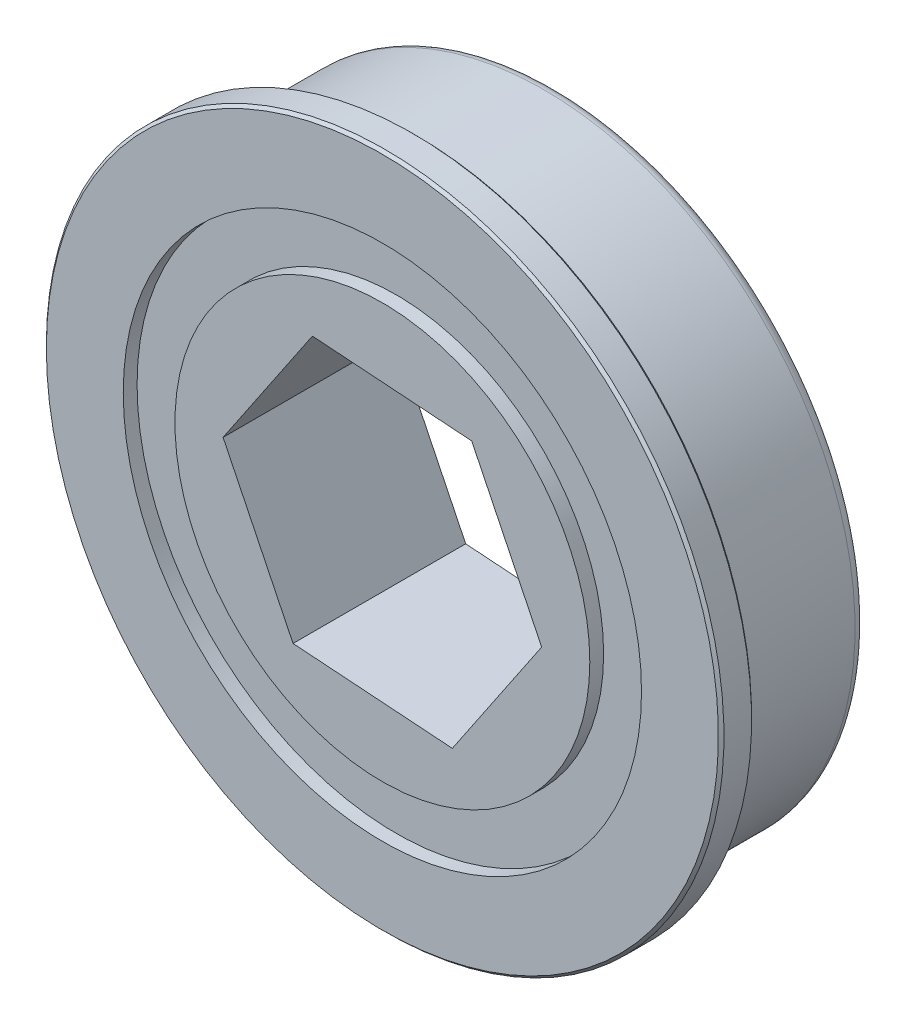
ISO-10303-21;
HEADER;
FILE_DESCRIPTION(('STEP AP214'),'2;1');
FILE_NAME('part.step','',(''),(''),'','','');
FILE_SCHEMA(('AUTOMOTIVE_DESIGN { 1 0 10303 214 1 1 1 1 }'));
ENDSEC;
DATA;
#1=APPLICATION_CONTEXT('core data for automotive mechanical design processes');
#2=APPLICATION_PROTOCOL_DEFINITION('international standard','automotive_design',2000,#1);
#3=PRODUCT_CONTEXT('',#1,'mechanical');
#4=PRODUCT('Part','Part','',(#3));
#5=PRODUCT_RELATED_PRODUCT_CATEGORY('part','',(#4));
#6=PRODUCT_DEFINITION_FORMATION('','',#4);
#7=PRODUCT_DEFINITION_CONTEXT('part definition',#1,'design');
#8=PRODUCT_DEFINITION('design','',#6,#7);
#9=PRODUCT_DEFINITION_SHAPE('','',#8);
#10=(LENGTH_UNIT() NAMED_UNIT(*) SI_UNIT(.MILLI.,.METRE.));
#11=(NAMED_UNIT(*) PLANE_ANGLE_UNIT() SI_UNIT($,.RADIAN.));
#12=(NAMED_UNIT(*) SI_UNIT($,.STERADIAN.) SOLID_ANGLE_UNIT());
#13=UNCERTAINTY_MEASURE_WITH_UNIT(LENGTH_MEASURE(1.E-05),#10,'distance_accuracy_value','');
#14=(GEOMETRIC_REPRESENTATION_CONTEXT(3) GLOBAL_UNCERTAINTY_ASSIGNED_CONTEXT((#13)) GLOBAL_UNIT_ASSIGNED_CONTEXT((#10,
#11,#12)) REPRESENTATION_CONTEXT('',''));
#15=CARTESIAN_POINT('',(0.,0.,0.));
#16=DIRECTION('',(0.,0.,1.));
#17=DIRECTION('',(1.,0.,0.));
#18=AXIS2_PLACEMENT_3D('',#15,#16,#17);
#19=CARTESIAN_POINT('',(0.,0.,-0.000999999999999265));
#20=DIRECTION('',(0.,0.,1.));
#21=DIRECTION('',(1.,0.,0.));
#22=AXIS2_PLACEMENT_3D('',#19,#20,#21);
#23=CYLINDRICAL_SURFACE('',#22,11.8991111578808);
#24=CARTESIAN_POINT('',(0.,0.,0.635));
#25=DIRECTION('',(0.,0.,-1.));
#26=DIRECTION('',(-1.,0.,0.));
#27=AXIS2_PLACEMENT_3D('',#24,#25,#26);
#28=CIRCLE('',#27,11.8991111578808);
#29=CARTESIAN_POINT('',(-11.8991111578808,0.,0.635));
#30=VERTEX_POINT('',#29);
#31=EDGE_CURVE('E154',#30,#30,#28,.T.);
#32=ORIENTED_EDGE('',*,*,#31,.F.);
#33=EDGE_LOOP('',(#32));
#34=FACE_BOUND('',#33,.T.);
#35=CARTESIAN_POINT('',(0.,0.,0.));
#36=DIRECTION('',(0.,0.,-1.));
#37=DIRECTION('',(-1.,0.,0.));
#38=AXIS2_PLACEMENT_3D('',#35,#36,#37);
#39=CIRCLE('',#38,11.8991111578808);
#40=CARTESIAN_POINT('',(-11.8991111578808,0.,0.));
#41=VERTEX_POINT('',#40);
#42=EDGE_CURVE('E158',#41,#41,#39,.F.);
#43=ORIENTED_EDGE('',*,*,#42,.F.);
#44=EDGE_LOOP('',(#43));
#45=FACE_BOUND('',#44,.T.);
#46=ADVANCED_FACE('F40',(#34,#45),#23,.F.);
#47=CARTESIAN_POINT('',(0.,0.,7.80034));
#48=DIRECTION('',(0.,0.,-1.));
#49=DIRECTION('',(-1.,0.,0.));
#50=AXIS2_PLACEMENT_3D('',#47,#48,#49);
#51=CONICAL_SURFACE('',#50,15.5575,0.785398163397442);
#52=CARTESIAN_POINT('',(0.,0.,7.92734));
#53=DIRECTION('',(0.,0.,-1.));
#54=DIRECTION('',(-1.,0.,0.));
#55=AXIS2_PLACEMENT_3D('',#52,#53,#54);
#56=CIRCLE('',#55,15.4305);
#57=CARTESIAN_POINT('',(-15.4305,0.,7.92734));
#58=VERTEX_POINT('',#57);
#59=EDGE_CURVE('E189',#58,#58,#56,.T.);
#60=ORIENTED_EDGE('',*,*,#59,.T.);
#61=EDGE_LOOP('',(#60));
#62=FACE_BOUND('',#61,.T.);
#63=CARTESIAN_POINT('',(0.,0.,7.80034));
#64=DIRECTION('',(0.,0.,-1.));
#65=DIRECTION('',(-1.,0.,0.));
#66=AXIS2_PLACEMENT_3D('',#63,#64,#65);
#67=CIRCLE('',#66,15.5575);
#68=CARTESIAN_POINT('',(-15.5575,0.,7.80034));
#69=VERTEX_POINT('',#68);
#70=EDGE_CURVE('E170',#69,#69,#67,.T.);
#71=ORIENTED_EDGE('',*,*,#70,.F.);
#72=EDGE_LOOP('',(#71));
#73=FACE_BOUND('',#72,.T.);
#74=ADVANCED_FACE('F221',(#62,#73),#51,.T.);
#75=CARTESIAN_POINT('',(15.4305,0.,7.92734));
#76=DIRECTION('',(0.,0.,1.));
#77=DIRECTION('',(1.,0.,0.));
#78=AXIS2_PLACEMENT_3D('',#75,#76,#77);
#79=PLANE('',#78);
#80=CARTESIAN_POINT('',(0.,0.,7.92734));
#81=DIRECTION('',(0.,0.,1.));
#82=DIRECTION('',(1.,0.,0.));
#83=AXIS2_PLACEMENT_3D('',#80,#81,#82);
#84=CIRCLE('',#83,11.8991111578808);
#85=CARTESIAN_POINT('',(11.8991111578808,0.,7.92734));
#86=VERTEX_POINT('',#85);
#87=EDGE_CURVE('E166',#86,#86,#84,.T.);
#88=ORIENTED_EDGE('',*,*,#87,.F.);
#89=EDGE_LOOP('',(#88));
#90=FACE_BOUND('',#89,.T.);
#91=ORIENTED_EDGE('',*,*,#59,.F.);
#92=EDGE_LOOP('',(#91));
#93=FACE_BOUND('',#92,.T.);
#94=ADVANCED_FACE('F226',(#90,#93),#79,.T.);
#95=CARTESIAN_POINT('',(0.,0.,0.));
#96=DIRECTION('',(0.,0.,-1.));
#97=DIRECTION('',(-1.,0.,0.));
#98=AXIS2_PLACEMENT_3D('',#95,#96,#97);
#99=PLANE('',#98);
#100=ORIENTED_EDGE('',*,*,#42,.T.);
#101=EDGE_LOOP('',(#100));
#102=FACE_BOUND('',#101,.T.);
#103=CARTESIAN_POINT('',(0.,0.,0.));
#104=DIRECTION('',(0.,0.,-1.));
#105=DIRECTION('',(-1.,0.,0.));
#106=AXIS2_PLACEMENT_3D('',#103,#104,#105);
#107=CIRCLE('',#106,13.7795);
#108=CARTESIAN_POINT('',(-13.7795,0.,0.));
#109=VERTEX_POINT('',#108);
#110=EDGE_CURVE('E49',#109,#109,#107,.T.);
#111=ORIENTED_EDGE('',*,*,#110,.T.);
#112=EDGE_LOOP('',(#111));
#113=FACE_BOUND('',#112,.T.);
#114=ADVANCED_FACE('F204',(#102,#113),#99,.T.);
#115=CARTESIAN_POINT('',(0.,0.,7.92734));
#116=DIRECTION('',(0.,0.,-1.));
#117=DIRECTION('',(-1.,0.,0.));
#118=AXIS2_PLACEMENT_3D('',#115,#116,#117);
#119=CYLINDRICAL_SURFACE('',#118,14.2875);
#120=CARTESIAN_POINT('',(0.,0.,0.508));
#121=DIRECTION('',(0.,0.,-1.));
#122=DIRECTION('',(-1.,0.,0.));
#123=AXIS2_PLACEMENT_3D('',#120,#121,#122);
#124=CIRCLE('',#123,14.2875);
#125=CARTESIAN_POINT('',(-14.2875,0.,0.508));
#126=VERTEX_POINT('',#125);
#127=EDGE_CURVE('E12',#126,#126,#124,.F.);
#128=ORIENTED_EDGE('',*,*,#127,.T.);
#129=EDGE_LOOP('',(#128));
#130=FACE_BOUND('',#129,.T.);
#131=CARTESIAN_POINT('',(0.,0.,5.89534));
#132=DIRECTION('',(0.,0.,-1.));
#133=DIRECTION('',(-1.,0.,0.));
#134=AXIS2_PLACEMENT_3D('',#131,#132,#133);
#135=CIRCLE('',#134,14.2875);
#136=CARTESIAN_POINT('',(-14.2875,0.,5.89534));
#137=VERTEX_POINT('',#136);
#138=EDGE_CURVE('E185',#137,#137,#135,.T.);
#139=ORIENTED_EDGE('',*,*,#138,.T.);
#140=EDGE_LOOP('',(#139));
#141=FACE_BOUND('',#140,.T.);
#142=ADVANCED_FACE('F249',(#130,#141),#119,.T.);
#143=CARTESIAN_POINT('',(14.2875,0.,5.89534));
#144=DIRECTION('',(0.,0.,1.));
#145=DIRECTION('',(1.,0.,0.));
#146=AXIS2_PLACEMENT_3D('',#143,#144,#145);
#147=PLANE('',#146);
#148=CARTESIAN_POINT('',(0.,0.,5.89534));
#149=DIRECTION('',(0.,0.,-1.));
#150=DIRECTION('',(-1.,0.,0.));
#151=AXIS2_PLACEMENT_3D('',#148,#149,#150);
#152=CIRCLE('',#151,13.97);
#153=CARTESIAN_POINT('',(-13.97,0.,5.89534));
#154=VERTEX_POINT('',#153);
#155=EDGE_CURVE('E181',#154,#154,#152,.T.);
#156=ORIENTED_EDGE('',*,*,#155,.T.);
#157=EDGE_LOOP('',(#156));
#158=FACE_BOUND('',#157,.T.);
#159=ORIENTED_EDGE('',*,*,#138,.F.);
#160=EDGE_LOOP('',(#159));
#161=FACE_BOUND('',#160,.T.);
#162=ADVANCED_FACE('F245',(#158,#161),#147,.T.);
#163=CARTESIAN_POINT('',(0.,0.,7.92734));
#164=DIRECTION('',(0.,0.,-1.));
#165=DIRECTION('',(-1.,0.,0.));
#166=AXIS2_PLACEMENT_3D('',#163,#164,#165);
#167=CYLINDRICAL_SURFACE('',#166,13.97);
#168=CARTESIAN_POINT('',(0.,0.,6.40333999999999));
#169=DIRECTION('',(0.,0.,-1.));
#170=DIRECTION('',(-1.,0.,0.));
#171=AXIS2_PLACEMENT_3D('',#168,#169,#170);
#172=CIRCLE('',#171,13.97);
#173=CARTESIAN_POINT('',(-13.97,0.,6.40333999999999));
#174=VERTEX_POINT('',#173);
#175=EDGE_CURVE('E177',#174,#174,#172,.T.);
#176=ORIENTED_EDGE('',*,*,#175,.T.);
#177=EDGE_LOOP('',(#176));
#178=FACE_BOUND('',#177,.T.);
#179=ORIENTED_EDGE('',*,*,#155,.F.);
#180=EDGE_LOOP('',(#179));
#181=FACE_BOUND('',#180,.T.);
#182=ADVANCED_FACE('F241',(#178,#181),#167,.T.);
#183=CARTESIAN_POINT('',(13.97,0.,6.40334));
#184=DIRECTION('',(0.,0.,-1.));
#185=DIRECTION('',(-1.,0.,0.));
#186=AXIS2_PLACEMENT_3D('',#183,#184,#185);
#187=PLANE('',#186);
#188=CARTESIAN_POINT('',(0.,0.,6.40334));
#189=DIRECTION('',(0.,0.,-1.));
#190=DIRECTION('',(-1.,0.,0.));
#191=AXIS2_PLACEMENT_3D('',#188,#189,#190);
#192=CIRCLE('',#191,15.4305);
#193=CARTESIAN_POINT('',(-15.4305,0.,6.40334));
#194=VERTEX_POINT('',#193);
#195=EDGE_CURVE('E193',#194,#194,#192,.T.);
#196=ORIENTED_EDGE('',*,*,#195,.T.);
#197=EDGE_LOOP('',(#196));
#198=FACE_BOUND('',#197,.T.);
#199=ORIENTED_EDGE('',*,*,#175,.F.);
#200=EDGE_LOOP('',(#199));
#201=FACE_BOUND('',#200,.T.);
#202=ADVANCED_FACE('F237',(#198,#201),#187,.T.);
#203=CARTESIAN_POINT('',(0.,0.,7.92734));
#204=DIRECTION('',(0.,0.,-1.));
#205=DIRECTION('',(-1.,0.,0.));
#206=AXIS2_PLACEMENT_3D('',#203,#204,#205);
#207=CYLINDRICAL_SURFACE('',#206,15.5575);
#208=CARTESIAN_POINT('',(0.,0.,6.53034000000001));
#209=DIRECTION('',(0.,0.,-1.));
#210=DIRECTION('',(-1.,0.,0.));
#211=AXIS2_PLACEMENT_3D('',#208,#209,#210);
#212=CIRCLE('',#211,15.5575);
#213=CARTESIAN_POINT('',(-15.5575,0.,6.53034000000001));
#214=VERTEX_POINT('',#213);
#215=EDGE_CURVE('E197',#214,#214,#212,.F.);
#216=ORIENTED_EDGE('',*,*,#215,.T.);
#217=EDGE_LOOP('',(#216));
#218=FACE_BOUND('',#217,.T.);
#219=ORIENTED_EDGE('',*,*,#70,.T.);
#220=EDGE_LOOP('',(#219));
#221=FACE_BOUND('',#220,.T.);
#222=ADVANCED_FACE('F217',(#218,#221),#207,.T.);
#223=CARTESIAN_POINT('',(0.,0.,6.40334));
#224=DIRECTION('',(0.,0.,1.));
#225=DIRECTION('',(1.,0.,0.));
#226=AXIS2_PLACEMENT_3D('',#223,#224,#225);
#227=CONICAL_SURFACE('',#226,15.4305,0.785398163397407);
#228=ORIENTED_EDGE('',*,*,#215,.F.);
#229=EDGE_LOOP('',(#228));
#230=FACE_BOUND('',#229,.T.);
#231=ORIENTED_EDGE('',*,*,#195,.F.);
#232=EDGE_LOOP('',(#231));
#233=FACE_BOUND('',#232,.T.);
#234=ADVANCED_FACE('F208',(#230,#233),#227,.T.);
#235=CARTESIAN_POINT('',(0.,0.,0.508));
#236=DIRECTION('',(0.,0.,-1.));
#237=DIRECTION('',(-1.,0.,0.));
#238=AXIS2_PLACEMENT_3D('',#235,#236,#237);
#239=TOROIDAL_SURFACE('',#238,13.7795,0.508);
#240=ORIENTED_EDGE('',*,*,#127,.F.);
#241=EDGE_LOOP('',(#240));
#242=FACE_BOUND('',#241,.T.);
#243=ORIENTED_EDGE('',*,*,#110,.F.);
#244=EDGE_LOOP('',(#243));
#245=FACE_BOUND('',#244,.T.);
#246=ADVANCED_FACE('F42',(#242,#245),#239,.T.);
#247=CARTESIAN_POINT('',(0.,0.,7.29234));
#248=DIRECTION('',(0.,0.,1.));
#249=DIRECTION('',(1.,0.,0.));
#250=AXIS2_PLACEMENT_3D('',#247,#248,#249);
#251=CIRCLE('',#250,11.8991111578808);
#252=CARTESIAN_POINT('',(11.8991111578808,0.,7.29234));
#253=VERTEX_POINT('',#252);
#254=EDGE_CURVE('E153',#253,#253,#251,.F.);
#255=ORIENTED_EDGE('',*,*,#254,.T.);
#256=EDGE_LOOP('',(#255));
#257=FACE_BOUND('',#256,.T.);
#258=ORIENTED_EDGE('',*,*,#87,.T.);
#259=EDGE_LOOP('',(#258));
#260=FACE_BOUND('',#259,.T.);
#261=ADVANCED_FACE('F207',(#257,#260),#23,.F.);
#262=CARTESIAN_POINT('',(0.,0.,0.635));
#263=DIRECTION('',(0.,0.,-1.));
#264=DIRECTION('',(-1.,0.,0.));
#265=AXIS2_PLACEMENT_3D('',#262,#263,#264);
#266=PLANE('',#265);
#267=CARTESIAN_POINT('',(0.,0.,0.635));
#268=DIRECTION('',(0.,0.,-1.));
#269=DIRECTION('',(-1.,0.,0.));
#270=AXIS2_PLACEMENT_3D('',#267,#268,#269);
#271=CIRCLE('',#270,9.525);
#272=CARTESIAN_POINT('',(-9.525,0.,0.635));
#273=VERTEX_POINT('',#272);
#274=EDGE_CURVE('E159',#273,#273,#271,.T.);
#275=ORIENTED_EDGE('',*,*,#274,.F.);
#276=EDGE_LOOP('',(#275));
#277=FACE_BOUND('',#276,.T.);
#278=ORIENTED_EDGE('',*,*,#31,.T.);
#279=EDGE_LOOP('',(#278));
#280=FACE_BOUND('',#279,.T.);
#281=ADVANCED_FACE('F214',(#277,#280),#266,.T.);
#282=CARTESIAN_POINT('',(15.4305,0.,7.29234));
#283=DIRECTION('',(0.,0.,1.));
#284=DIRECTION('',(1.,0.,0.));
#285=AXIS2_PLACEMENT_3D('',#282,#283,#284);
#286=PLANE('',#285);
#287=ORIENTED_EDGE('',*,*,#254,.F.);
#288=EDGE_LOOP('',(#287));
#289=FACE_BOUND('',#288,.T.);
#290=CARTESIAN_POINT('',(0.,0.,7.29234));
#291=DIRECTION('',(0.,0.,1.));
#292=DIRECTION('',(1.,0.,0.));
#293=AXIS2_PLACEMENT_3D('',#290,#291,#292);
#294=CIRCLE('',#293,9.525);
#295=CARTESIAN_POINT('',(9.525,0.,7.29234));
#296=VERTEX_POINT('',#295);
#297=EDGE_CURVE('E149',#296,#296,#294,.T.);
#298=ORIENTED_EDGE('',*,*,#297,.F.);
#299=EDGE_LOOP('',(#298));
#300=FACE_BOUND('',#299,.T.);
#301=ADVANCED_FACE('F233',(#289,#300),#286,.T.);
#302=CARTESIAN_POINT('',(0.,0.,34.8681083632075));
#303=DIRECTION('',(0.,0.,-1.));
#304=DIRECTION('',(-1.,0.,0.));
#305=AXIS2_PLACEMENT_3D('',#302,#303,#304);
#306=CYLINDRICAL_SURFACE('',#305,9.525);
#307=ORIENTED_EDGE('',*,*,#274,.T.);
#308=EDGE_LOOP('',(#307));
#309=FACE_BOUND('',#308,.T.);
#310=CARTESIAN_POINT('',(0.,0.,0.));
#311=DIRECTION('',(0.,0.,-1.));
#312=DIRECTION('',(-1.,0.,0.));
#313=AXIS2_PLACEMENT_3D('',#310,#311,#312);
#314=CIRCLE('',#313,9.525);
#315=CARTESIAN_POINT('',(-9.525,0.,0.));
#316=VERTEX_POINT('',#315);
#317=EDGE_CURVE('E449',#316,#316,#314,.T.);
#318=ORIENTED_EDGE('',*,*,#317,.F.);
#319=EDGE_LOOP('',(#318));
#320=FACE_BOUND('',#319,.T.);
#321=ADVANCED_FACE('F344',(#309,#320),#306,.T.);
#322=ORIENTED_EDGE('',*,*,#297,.T.);
#323=EDGE_LOOP('',(#322));
#324=FACE_BOUND('',#323,.T.);
#325=CARTESIAN_POINT('',(0.,0.,7.92734));
#326=DIRECTION('',(0.,0.,1.));
#327=DIRECTION('',(1.,0.,0.));
#328=AXIS2_PLACEMENT_3D('',#325,#326,#327);
#329=CIRCLE('',#328,9.525);
#330=CARTESIAN_POINT('',(9.525,0.,7.92734));
#331=VERTEX_POINT('',#330);
#332=EDGE_CURVE('E137',#331,#331,#329,.F.);
#333=ORIENTED_EDGE('',*,*,#332,.T.);
#334=EDGE_LOOP('',(#333));
#335=FACE_BOUND('',#334,.T.);
#336=ADVANCED_FACE('F352',(#324,#335),#306,.T.);
#337=CARTESIAN_POINT('',(7.31433054001112,-0.513714010705348,34.8681083632075));
#338=DIRECTION('',(0.828866647753209,-0.559446226408184,0.));
#339=DIRECTION('',(0.559446226408184,0.828866647753209,0.));
#340=AXIS2_PLACEMENT_3D('',#337,#338,#339);
#341=PLANE('',#340);
#342=DIRECTION('',(-0.559446226408184,-0.828866647753209,0.));
#343=VECTOR('',#342,1.);
#344=CARTESIAN_POINT('',(7.31433054001112,-0.513714010705348,7.92734));
#345=LINE('',#344,#343);
#346=CARTESIAN_POINT('',(7.31433054001112,-0.513714010705348,7.92734));
#347=VERTEX_POINT('',#346);
#348=CARTESIAN_POINT('',(3.21227588645474,-6.59125306467865,7.92734));
#349=VERTEX_POINT('',#348);
#350=EDGE_CURVE('E129',#347,#349,#345,.T.);
#351=ORIENTED_EDGE('',*,*,#350,.F.);
#352=DIRECTION('',(0.,0.,-1.));
#353=VECTOR('',#352,1.);
#354=CARTESIAN_POINT('',(7.31433054001112,-0.513714010705348,34.8681083632075));
#355=LINE('',#354,#353);
#356=CARTESIAN_POINT('',(7.31433054001112,-0.513714010705348,0.));
#357=VERTEX_POINT('',#356);
#358=EDGE_CURVE('E133',#347,#357,#355,.T.);
#359=ORIENTED_EDGE('',*,*,#358,.T.);
#360=DIRECTION('',(-0.559446226408184,-0.828866647753209,0.));
#361=VECTOR('',#360,1.);
#362=CARTESIAN_POINT('',(7.31433054001112,-0.513714010705348,0.));
#363=LINE('',#362,#361);
#364=CARTESIAN_POINT('',(3.21227588645474,-6.59125306467865,0.));
#365=VERTEX_POINT('',#364);
#366=EDGE_CURVE('E136',#357,#365,#363,.T.);
#367=ORIENTED_EDGE('',*,*,#366,.T.);
#368=DIRECTION('',(0.,0.,-1.));
#369=VECTOR('',#368,1.);
#370=CARTESIAN_POINT('',(3.21227588645474,-6.59125306467865,34.8681083632075));
#371=LINE('',#370,#369);
#372=EDGE_CURVE('E68',#349,#365,#371,.T.);
#373=ORIENTED_EDGE('',*,*,#372,.F.);
#374=EDGE_LOOP('',(#351,#359,#367,#373));
#375=FACE_BOUND('',#374,.T.);
#376=ADVANCED_FACE('F362',(#375),#341,.F.);
#377=CARTESIAN_POINT('',(4.10205465355639,6.0775390539733,34.8681083632075));
#378=DIRECTION('',(0.898927967997433,0.438096460099835,0.));
#379=DIRECTION('',(-0.438096460099835,0.898927967997433,0.));
#380=AXIS2_PLACEMENT_3D('',#377,#378,#379);
#381=PLANE('',#380);
#382=DIRECTION('',(0.438096460099835,-0.898927967997433,0.));
#383=VECTOR('',#382,1.);
#384=CARTESIAN_POINT('',(4.10205465355639,6.0775390539733,7.92734));
#385=LINE('',#384,#383);
#386=CARTESIAN_POINT('',(4.10205465355639,6.0775390539733,7.92734));
#387=VERTEX_POINT('',#386);
#388=EDGE_CURVE('E447',#387,#347,#385,.T.);
#389=ORIENTED_EDGE('',*,*,#388,.F.);
#390=DIRECTION('',(0.,0.,-1.));
#391=VECTOR('',#390,1.);
#392=CARTESIAN_POINT('',(4.10205465355639,6.0775390539733,34.8681083632075));
#393=LINE('',#392,#391);
#394=CARTESIAN_POINT('',(4.10205465355639,6.0775390539733,0.));
#395=VERTEX_POINT('',#394);
#396=EDGE_CURVE('E138',#387,#395,#393,.T.);
#397=ORIENTED_EDGE('',*,*,#396,.T.);
#398=DIRECTION('',(0.438096460099835,-0.898927967997433,0.));
#399=VECTOR('',#398,1.);
#400=CARTESIAN_POINT('',(4.10205465355639,6.0775390539733,0.));
#401=LINE('',#400,#399);
#402=EDGE_CURVE('E141',#395,#357,#401,.T.);
#403=ORIENTED_EDGE('',*,*,#402,.T.);
#404=ORIENTED_EDGE('',*,*,#358,.F.);
#405=EDGE_LOOP('',(#389,#397,#403,#404));
#406=FACE_BOUND('',#405,.T.);
#407=ADVANCED_FACE('F372',(#406),#381,.F.);
#408=CARTESIAN_POINT('',(-3.21227588645473,6.59125306467865,34.8681083632075));
#409=DIRECTION('',(0.0700613202442238,0.997542686508019,0.));
#410=DIRECTION('',(-0.997542686508019,0.0700613202442238,0.));
#411=AXIS2_PLACEMENT_3D('',#408,#409,#410);
#412=PLANE('',#411);
#413=DIRECTION('',(0.997542686508019,-0.0700613202442238,0.));
#414=VECTOR('',#413,1.);
#415=CARTESIAN_POINT('',(-3.21227588645473,6.59125306467865,7.92734));
#416=LINE('',#415,#414);
#417=CARTESIAN_POINT('',(-3.21227588645473,6.59125306467865,7.92734));
#418=VERTEX_POINT('',#417);
#419=EDGE_CURVE('E108',#418,#387,#416,.T.);
#420=ORIENTED_EDGE('',*,*,#419,.F.);
#421=DIRECTION('',(0.,0.,-1.));
#422=VECTOR('',#421,1.);
#423=CARTESIAN_POINT('',(-3.21227588645473,6.59125306467865,34.8681083632075));
#424=LINE('',#423,#422);
#425=CARTESIAN_POINT('',(-3.21227588645473,6.59125306467865,0.));
#426=VERTEX_POINT('',#425);
#427=EDGE_CURVE('E103',#418,#426,#424,.T.);
#428=ORIENTED_EDGE('',*,*,#427,.T.);
#429=DIRECTION('',(0.997542686508019,-0.0700613202442238,0.));
#430=VECTOR('',#429,1.);
#431=CARTESIAN_POINT('',(-3.21227588645473,6.59125306467865,0.));
#432=LINE('',#431,#430);
#433=EDGE_CURVE('E119',#426,#395,#432,.T.);
#434=ORIENTED_EDGE('',*,*,#433,.T.);
#435=ORIENTED_EDGE('',*,*,#396,.F.);
#436=EDGE_LOOP('',(#420,#428,#434,#435));
#437=FACE_BOUND('',#436,.T.);
#438=ADVANCED_FACE('F381',(#437),#412,.F.);
#439=CARTESIAN_POINT('',(-7.31433054001111,0.513714010705348,34.8681083632075));
#440=DIRECTION('',(-0.828866647753209,0.559446226408184,0.));
#441=DIRECTION('',(-0.559446226408184,-0.828866647753209,0.));
#442=AXIS2_PLACEMENT_3D('',#439,#440,#441);
#443=PLANE('',#442);
#444=DIRECTION('',(0.559446226408184,0.828866647753209,0.));
#445=VECTOR('',#444,1.);
#446=CARTESIAN_POINT('',(-7.31433054001111,0.513714010705348,7.92734));
#447=LINE('',#446,#445);
#448=CARTESIAN_POINT('',(-7.31433054001111,0.513714010705348,7.92734));
#449=VERTEX_POINT('',#448);
#450=EDGE_CURVE('E101',#449,#418,#447,.T.);
#451=ORIENTED_EDGE('',*,*,#450,.F.);
#452=DIRECTION('',(0.,0.,-1.));
#453=VECTOR('',#452,1.);
#454=CARTESIAN_POINT('',(-7.31433054001111,0.513714010705348,34.8681083632075));
#455=LINE('',#454,#453);
#456=CARTESIAN_POINT('',(-7.31433054001111,0.513714010705348,0.));
#457=VERTEX_POINT('',#456);
#458=EDGE_CURVE('E97',#449,#457,#455,.T.);
#459=ORIENTED_EDGE('',*,*,#458,.T.);
#460=DIRECTION('',(0.559446226408184,0.828866647753209,0.));
#461=VECTOR('',#460,1.);
#462=CARTESIAN_POINT('',(-7.31433054001111,0.513714010705348,0.));
#463=LINE('',#462,#461);
#464=EDGE_CURVE('E118',#457,#426,#463,.T.);
#465=ORIENTED_EDGE('',*,*,#464,.T.);
#466=ORIENTED_EDGE('',*,*,#427,.F.);
#467=EDGE_LOOP('',(#451,#459,#465,#466));
#468=FACE_BOUND('',#467,.T.);
#469=ADVANCED_FACE('F102',(#468),#443,.F.);
#470=CARTESIAN_POINT('',(-4.10205465355638,-6.0775390539733,34.8681083632075));
#471=DIRECTION('',(-0.898927967997433,-0.438096460099835,0.));
#472=DIRECTION('',(0.438096460099835,-0.898927967997433,0.));
#473=AXIS2_PLACEMENT_3D('',#470,#471,#472);
#474=PLANE('',#473);
#475=DIRECTION('',(-0.438096460099835,0.898927967997433,0.));
#476=VECTOR('',#475,1.);
#477=CARTESIAN_POINT('',(-4.10205465355638,-6.0775390539733,7.92734));
#478=LINE('',#477,#476);
#479=CARTESIAN_POINT('',(-4.10205465355638,-6.0775390539733,7.92734));
#480=VERTEX_POINT('',#479);
#481=EDGE_CURVE('E109',#480,#449,#478,.T.);
#482=ORIENTED_EDGE('',*,*,#481,.F.);
#483=DIRECTION('',(0.,0.,-1.));
#484=VECTOR('',#483,1.);
#485=CARTESIAN_POINT('',(-4.10205465355638,-6.0775390539733,34.8681083632075));
#486=LINE('',#485,#484);
#487=CARTESIAN_POINT('',(-4.10205465355638,-6.0775390539733,0.));
#488=VERTEX_POINT('',#487);
#489=EDGE_CURVE('E59',#480,#488,#486,.T.);
#490=ORIENTED_EDGE('',*,*,#489,.T.);
#491=DIRECTION('',(-0.438096460099835,0.898927967997433,0.));
#492=VECTOR('',#491,1.);
#493=CARTESIAN_POINT('',(-4.10205465355638,-6.0775390539733,0.));
#494=LINE('',#493,#492);
#495=EDGE_CURVE('E115',#488,#457,#494,.T.);
#496=ORIENTED_EDGE('',*,*,#495,.T.);
#497=ORIENTED_EDGE('',*,*,#458,.F.);
#498=EDGE_LOOP('',(#482,#490,#496,#497));
#499=FACE_BOUND('',#498,.T.);
#500=ADVANCED_FACE('F112',(#499),#474,.F.);
#501=CARTESIAN_POINT('',(3.21227588645474,-6.59125306467865,34.8681083632075));
#502=DIRECTION('',(-0.0700613202442235,-0.997542686508019,0.));
#503=DIRECTION('',(0.997542686508019,-0.0700613202442235,0.));
#504=AXIS2_PLACEMENT_3D('',#501,#502,#503);
#505=PLANE('',#504);
#506=DIRECTION('',(-0.997542686508019,0.0700613202442235,0.));
#507=VECTOR('',#506,1.);
#508=CARTESIAN_POINT('',(3.21227588645474,-6.59125306467865,7.92734));
#509=LINE('',#508,#507);
#510=EDGE_CURVE('E124',#349,#480,#509,.T.);
#511=ORIENTED_EDGE('',*,*,#510,.F.);
#512=ORIENTED_EDGE('',*,*,#372,.T.);
#513=DIRECTION('',(-0.997542686508019,0.0700613202442235,0.));
#514=VECTOR('',#513,1.);
#515=CARTESIAN_POINT('',(3.21227588645474,-6.59125306467865,0.));
#516=LINE('',#515,#514);
#517=EDGE_CURVE('E148',#365,#488,#516,.T.);
#518=ORIENTED_EDGE('',*,*,#517,.T.);
#519=ORIENTED_EDGE('',*,*,#489,.F.);
#520=EDGE_LOOP('',(#511,#512,#518,#519));
#521=FACE_BOUND('',#520,.T.);
#522=ADVANCED_FACE('F407',(#521),#505,.F.);
#523=CARTESIAN_POINT('',(0.,0.,0.));
#524=DIRECTION('',(0.,0.,-1.));
#525=DIRECTION('',(-1.,0.,0.));
#526=AXIS2_PLACEMENT_3D('',#523,#524,#525);
#527=PLANE('',#526);
#528=ORIENTED_EDGE('',*,*,#366,.F.);
#529=ORIENTED_EDGE('',*,*,#402,.F.);
#530=ORIENTED_EDGE('',*,*,#433,.F.);
#531=ORIENTED_EDGE('',*,*,#464,.F.);
#532=ORIENTED_EDGE('',*,*,#495,.F.);
#533=ORIENTED_EDGE('',*,*,#517,.F.);
#534=EDGE_LOOP('',(#528,#529,#530,#531,#532,#533));
#535=FACE_BOUND('',#534,.T.);
#536=ORIENTED_EDGE('',*,*,#317,.T.);
#537=EDGE_LOOP('',(#536));
#538=FACE_BOUND('',#537,.T.);
#539=ADVANCED_FACE('F416',(#535,#538),#527,.T.);
#540=CARTESIAN_POINT('',(15.4305,0.,7.92734));
#541=DIRECTION('',(0.,0.,1.));
#542=DIRECTION('',(1.,0.,0.));
#543=AXIS2_PLACEMENT_3D('',#540,#541,#542);
#544=PLANE('',#543);
#545=ORIENTED_EDGE('',*,*,#332,.F.);
#546=EDGE_LOOP('',(#545));
#547=FACE_BOUND('',#546,.T.);
#548=ORIENTED_EDGE('',*,*,#388,.T.);
#549=ORIENTED_EDGE('',*,*,#350,.T.);
#550=ORIENTED_EDGE('',*,*,#510,.T.);
#551=ORIENTED_EDGE('',*,*,#481,.T.);
#552=ORIENTED_EDGE('',*,*,#450,.T.);
#553=ORIENTED_EDGE('',*,*,#419,.T.);
#554=EDGE_LOOP('',(#548,#549,#550,#551,#552,#553));
#555=FACE_BOUND('',#554,.T.);
#556=ADVANCED_FACE('F122',(#547,#555),#544,.T.);
#557=CLOSED_SHELL('',(#46,#74,#94,#114,#142,#162,#182,#202,#222,#234,#246,#261,#281,#301,#321,
#336,#376,#407,#438,#469,#500,#522,#539,#556));
#558=MANIFOLD_SOLID_BREP('B2',#557);
#559=ADVANCED_BREP_SHAPE_REPRESENTATION('',(#18,#558),#14);
#560=SHAPE_DEFINITION_REPRESENTATION(#9,#559);
ENDSEC;
END-ISO-10303-21;
